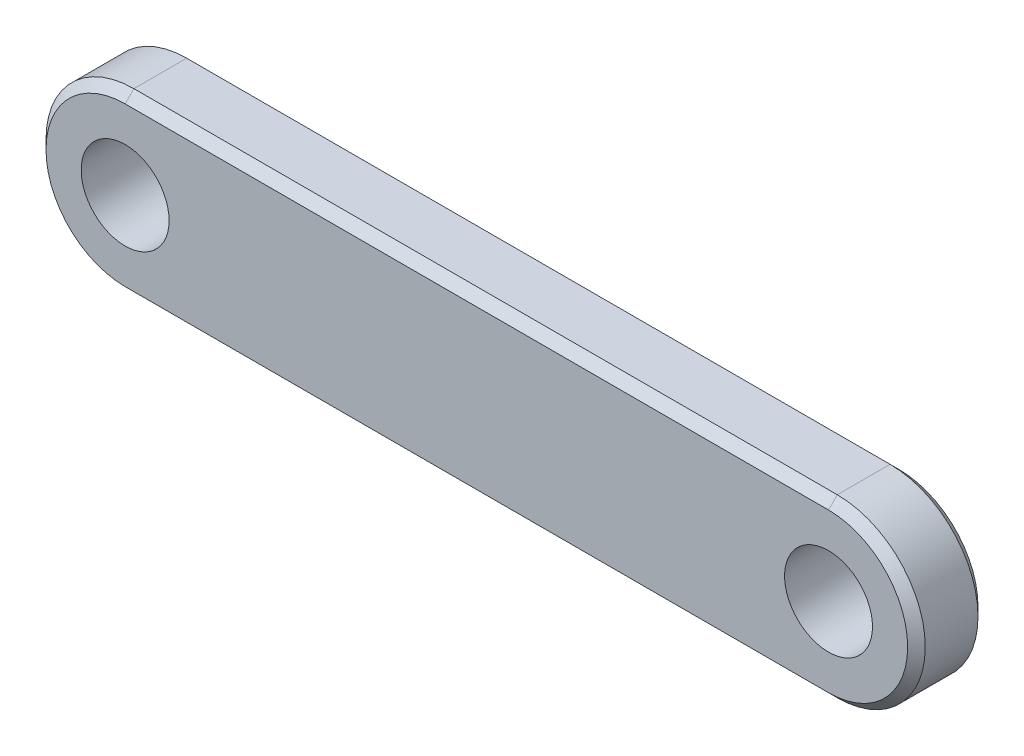
ISO-10303-21;
HEADER;
FILE_DESCRIPTION(('STEP AP214'),'2;1');
FILE_NAME('part.step','',(''),(''),'','','');
FILE_SCHEMA(('AUTOMOTIVE_DESIGN { 1 0 10303 214 1 1 1 1 }'));
ENDSEC;
DATA;
#1=APPLICATION_CONTEXT('core data for automotive mechanical design processes');
#2=APPLICATION_PROTOCOL_DEFINITION('international standard','automotive_design',2000,#1);
#3=PRODUCT_CONTEXT('',#1,'mechanical');
#4=PRODUCT('Part','Part','',(#3));
#5=PRODUCT_RELATED_PRODUCT_CATEGORY('part','',(#4));
#6=PRODUCT_DEFINITION_FORMATION('','',#4);
#7=PRODUCT_DEFINITION_CONTEXT('part definition',#1,'design');
#8=PRODUCT_DEFINITION('design','',#6,#7);
#9=PRODUCT_DEFINITION_SHAPE('','',#8);
#10=(LENGTH_UNIT() NAMED_UNIT(*) SI_UNIT(.MILLI.,.METRE.));
#11=(NAMED_UNIT(*) PLANE_ANGLE_UNIT() SI_UNIT($,.RADIAN.));
#12=(NAMED_UNIT(*) SI_UNIT($,.STERADIAN.) SOLID_ANGLE_UNIT());
#13=UNCERTAINTY_MEASURE_WITH_UNIT(LENGTH_MEASURE(1.E-05),#10,'distance_accuracy_value','');
#14=(GEOMETRIC_REPRESENTATION_CONTEXT(3) GLOBAL_UNCERTAINTY_ASSIGNED_CONTEXT((#13)) GLOBAL_UNIT_ASSIGNED_CONTEXT((#10,
#11,#12)) REPRESENTATION_CONTEXT('',''));
#15=CARTESIAN_POINT('',(0.,0.,0.));
#16=DIRECTION('',(0.,0.,1.));
#17=DIRECTION('',(1.,0.,0.));
#18=AXIS2_PLACEMENT_3D('',#15,#16,#17);
#19=CARTESIAN_POINT('',(-20.,0.,-4.));
#20=DIRECTION('',(0.,0.,1.));
#21=DIRECTION('',(1.,0.,0.));
#22=AXIS2_PLACEMENT_3D('',#19,#20,#21);
#23=CYLINDRICAL_SURFACE('',#22,5.);
#24=DIRECTION('',(0.,0.,1.));
#25=VECTOR('',#24,1.);
#26=CARTESIAN_POINT('',(-20.,5.,-4.));
#27=LINE('',#26,#25);
#28=CARTESIAN_POINT('',(-20.,5.,-3.49999999999999));
#29=VERTEX_POINT('',#28);
#30=CARTESIAN_POINT('',(-20.,5.,-0.5));
#31=VERTEX_POINT('',#30);
#32=EDGE_CURVE('E115',#29,#31,#27,.T.);
#33=ORIENTED_EDGE('',*,*,#32,.F.);
#34=CARTESIAN_POINT('',(-20.,0.,-3.49999999999999));
#35=DIRECTION('',(0.,0.,1.));
#36=DIRECTION('',(1.,0.,0.));
#37=AXIS2_PLACEMENT_3D('',#34,#35,#36);
#38=CIRCLE('',#37,5.);
#39=CARTESIAN_POINT('',(-20.,-5.,-3.49999999999999));
#40=VERTEX_POINT('',#39);
#41=EDGE_CURVE('E111',#29,#40,#38,.T.);
#42=ORIENTED_EDGE('',*,*,#41,.T.);
#43=DIRECTION('',(0.,0.,1.));
#44=VECTOR('',#43,1.);
#45=CARTESIAN_POINT('',(-20.,-5.,-4.));
#46=LINE('',#45,#44);
#47=CARTESIAN_POINT('',(-20.,-5.,-0.5));
#48=VERTEX_POINT('',#47);
#49=EDGE_CURVE('E113',#40,#48,#46,.T.);
#50=ORIENTED_EDGE('',*,*,#49,.T.);
#51=CARTESIAN_POINT('',(-20.,0.,-0.5));
#52=DIRECTION('',(0.,0.,1.));
#53=DIRECTION('',(1.,0.,0.));
#54=AXIS2_PLACEMENT_3D('',#51,#52,#53);
#55=CIRCLE('',#54,5.);
#56=EDGE_CURVE('E121',#48,#31,#55,.F.);
#57=ORIENTED_EDGE('',*,*,#56,.T.);
#58=EDGE_LOOP('',(#33,#42,#50,#57));
#59=FACE_BOUND('',#58,.T.);
#60=ADVANCED_FACE('F41',(#59),#23,.T.);
#61=CARTESIAN_POINT('',(-20.,5.,-4.));
#62=DIRECTION('',(0.,1.,0.));
#63=DIRECTION('',(0.,0.,1.));
#64=AXIS2_PLACEMENT_3D('',#61,#62,#63);
#65=PLANE('',#64);
#66=DIRECTION('',(0.,0.,1.));
#67=VECTOR('',#66,1.);
#68=CARTESIAN_POINT('',(20.,5.,-4.));
#69=LINE('',#68,#67);
#70=CARTESIAN_POINT('',(20.,5.,-3.49999999999999));
#71=VERTEX_POINT('',#70);
#72=CARTESIAN_POINT('',(20.,5.,-0.5));
#73=VERTEX_POINT('',#72);
#74=EDGE_CURVE('E195',#71,#73,#69,.T.);
#75=ORIENTED_EDGE('',*,*,#74,.F.);
#76=DIRECTION('',(-1.,0.,0.));
#77=VECTOR('',#76,1.);
#78=CARTESIAN_POINT('',(-20.,5.,-3.49999999999999));
#79=LINE('',#78,#77);
#80=EDGE_CURVE('E164',#71,#29,#79,.T.);
#81=ORIENTED_EDGE('',*,*,#80,.T.);
#82=ORIENTED_EDGE('',*,*,#32,.T.);
#83=DIRECTION('',(1.,0.,0.));
#84=VECTOR('',#83,1.);
#85=CARTESIAN_POINT('',(-20.,5.,-0.5));
#86=LINE('',#85,#84);
#87=EDGE_CURVE('E120',#31,#73,#86,.T.);
#88=ORIENTED_EDGE('',*,*,#87,.T.);
#89=EDGE_LOOP('',(#75,#81,#82,#88));
#90=FACE_BOUND('',#89,.T.);
#91=ADVANCED_FACE('F194',(#90),#65,.T.);
#92=CARTESIAN_POINT('',(20.,0.,-4.));
#93=DIRECTION('',(0.,0.,1.));
#94=DIRECTION('',(1.,0.,0.));
#95=AXIS2_PLACEMENT_3D('',#92,#93,#94);
#96=CYLINDRICAL_SURFACE('',#95,5.);
#97=DIRECTION('',(0.,0.,1.));
#98=VECTOR('',#97,1.);
#99=CARTESIAN_POINT('',(20.,-5.,-4.));
#100=LINE('',#99,#98);
#101=CARTESIAN_POINT('',(20.,-5.,-3.49999999999999));
#102=VERTEX_POINT('',#101);
#103=CARTESIAN_POINT('',(20.,-5.,-0.5));
#104=VERTEX_POINT('',#103);
#105=EDGE_CURVE('E132',#102,#104,#100,.T.);
#106=ORIENTED_EDGE('',*,*,#105,.F.);
#107=CARTESIAN_POINT('',(20.,0.,-3.49999999999999));
#108=DIRECTION('',(0.,0.,1.));
#109=DIRECTION('',(1.,0.,0.));
#110=AXIS2_PLACEMENT_3D('',#107,#108,#109);
#111=CIRCLE('',#110,5.);
#112=EDGE_CURVE('E160',#102,#71,#111,.T.);
#113=ORIENTED_EDGE('',*,*,#112,.T.);
#114=ORIENTED_EDGE('',*,*,#74,.T.);
#115=CARTESIAN_POINT('',(20.,0.,-0.5));
#116=DIRECTION('',(0.,0.,1.));
#117=DIRECTION('',(1.,0.,0.));
#118=AXIS2_PLACEMENT_3D('',#115,#116,#117);
#119=CIRCLE('',#118,5.);
#120=EDGE_CURVE('E158',#73,#104,#119,.F.);
#121=ORIENTED_EDGE('',*,*,#120,.T.);
#122=EDGE_LOOP('',(#106,#113,#114,#121));
#123=FACE_BOUND('',#122,.T.);
#124=ADVANCED_FACE('F198',(#123),#96,.T.);
#125=CARTESIAN_POINT('',(-20.,-5.,-4.));
#126=DIRECTION('',(0.,-1.,0.));
#127=DIRECTION('',(0.,0.,-1.));
#128=AXIS2_PLACEMENT_3D('',#125,#126,#127);
#129=PLANE('',#128);
#130=ORIENTED_EDGE('',*,*,#49,.F.);
#131=DIRECTION('',(1.,0.,0.));
#132=VECTOR('',#131,1.);
#133=CARTESIAN_POINT('',(20.,-5.,-3.49999999999999));
#134=LINE('',#133,#132);
#135=EDGE_CURVE('E129',#40,#102,#134,.T.);
#136=ORIENTED_EDGE('',*,*,#135,.T.);
#137=ORIENTED_EDGE('',*,*,#105,.T.);
#138=DIRECTION('',(-1.,0.,0.));
#139=VECTOR('',#138,1.);
#140=CARTESIAN_POINT('',(-20.,-5.,-0.5));
#141=LINE('',#140,#139);
#142=EDGE_CURVE('E131',#104,#48,#141,.T.);
#143=ORIENTED_EDGE('',*,*,#142,.T.);
#144=EDGE_LOOP('',(#130,#136,#137,#143));
#145=FACE_BOUND('',#144,.T.);
#146=ADVANCED_FACE('F126',(#145),#129,.T.);
#147=CARTESIAN_POINT('',(-20.,0.,-4.));
#148=DIRECTION('',(0.,0.,1.));
#149=DIRECTION('',(1.,0.,0.));
#150=AXIS2_PLACEMENT_3D('',#147,#148,#149);
#151=PLANE('',#150);
#152=CARTESIAN_POINT('',(20.,0.,-4.));
#153=DIRECTION('',(0.,0.,1.));
#154=DIRECTION('',(1.,0.,0.));
#155=AXIS2_PLACEMENT_3D('',#152,#153,#154);
#156=CIRCLE('',#155,4.49999999999999);
#157=CARTESIAN_POINT('',(20.,4.49999999999999,-4.));
#158=VERTEX_POINT('',#157);
#159=CARTESIAN_POINT('',(20.,-4.49999999999999,-4.));
#160=VERTEX_POINT('',#159);
#161=EDGE_CURVE('E154',#158,#160,#156,.F.);
#162=ORIENTED_EDGE('',*,*,#161,.T.);
#163=DIRECTION('',(-1.,0.,0.));
#164=VECTOR('',#163,1.);
#165=CARTESIAN_POINT('',(-20.,-4.5,-4.));
#166=LINE('',#165,#164);
#167=CARTESIAN_POINT('',(-20.,-4.49999999999999,-4.));
#168=VERTEX_POINT('',#167);
#169=EDGE_CURVE('E156',#160,#168,#166,.T.);
#170=ORIENTED_EDGE('',*,*,#169,.T.);
#171=CARTESIAN_POINT('',(-20.,0.,-4.));
#172=DIRECTION('',(0.,0.,1.));
#173=DIRECTION('',(1.,0.,0.));
#174=AXIS2_PLACEMENT_3D('',#171,#172,#173);
#175=CIRCLE('',#174,4.49999999999999);
#176=CARTESIAN_POINT('',(-20.,4.49999999999999,-4.));
#177=VERTEX_POINT('',#176);
#178=EDGE_CURVE('E138',#168,#177,#175,.F.);
#179=ORIENTED_EDGE('',*,*,#178,.T.);
#180=DIRECTION('',(1.,0.,0.));
#181=VECTOR('',#180,1.);
#182=CARTESIAN_POINT('',(20.,4.49999999999999,-4.));
#183=LINE('',#182,#181);
#184=EDGE_CURVE('E148',#177,#158,#183,.T.);
#185=ORIENTED_EDGE('',*,*,#184,.T.);
#186=EDGE_LOOP('',(#162,#170,#179,#185));
#187=FACE_BOUND('',#186,.T.);
#188=CARTESIAN_POINT('',(20.,0.,-4.));
#189=DIRECTION('',(0.,0.,1.));
#190=DIRECTION('',(1.,0.,0.));
#191=AXIS2_PLACEMENT_3D('',#188,#189,#190);
#192=CIRCLE('',#191,2.5);
#193=CARTESIAN_POINT('',(22.5,0.,-4.));
#194=VERTEX_POINT('',#193);
#195=EDGE_CURVE('E206',#194,#194,#192,.T.);
#196=ORIENTED_EDGE('',*,*,#195,.T.);
#197=EDGE_LOOP('',(#196));
#198=FACE_BOUND('',#197,.T.);
#199=CARTESIAN_POINT('',(-20.,0.,-4.));
#200=DIRECTION('',(0.,0.,1.));
#201=DIRECTION('',(1.,0.,0.));
#202=AXIS2_PLACEMENT_3D('',#199,#200,#201);
#203=CIRCLE('',#202,2.5);
#204=CARTESIAN_POINT('',(-17.5,0.,-4.));
#205=VERTEX_POINT('',#204);
#206=EDGE_CURVE('E133',#205,#205,#203,.T.);
#207=ORIENTED_EDGE('',*,*,#206,.T.);
#208=EDGE_LOOP('',(#207));
#209=FACE_BOUND('',#208,.T.);
#210=ADVANCED_FACE('F214',(#187,#198,#209),#151,.F.);
#211=CARTESIAN_POINT('',(-20.,0.,0.));
#212=DIRECTION('',(0.,0.,1.));
#213=DIRECTION('',(1.,0.,0.));
#214=AXIS2_PLACEMENT_3D('',#211,#212,#213);
#215=PLANE('',#214);
#216=CARTESIAN_POINT('',(-20.,0.,0.));
#217=DIRECTION('',(0.,0.,1.));
#218=DIRECTION('',(1.,0.,0.));
#219=AXIS2_PLACEMENT_3D('',#216,#217,#218);
#220=CIRCLE('',#219,4.5);
#221=CARTESIAN_POINT('',(-20.,4.5,0.));
#222=VERTEX_POINT('',#221);
#223=CARTESIAN_POINT('',(-20.,-4.5,0.));
#224=VERTEX_POINT('',#223);
#225=EDGE_CURVE('E65',#222,#224,#220,.T.);
#226=ORIENTED_EDGE('',*,*,#225,.T.);
#227=DIRECTION('',(1.,0.,0.));
#228=VECTOR('',#227,1.);
#229=CARTESIAN_POINT('',(-20.,-4.5,0.));
#230=LINE('',#229,#228);
#231=CARTESIAN_POINT('',(20.,-4.5,0.));
#232=VERTEX_POINT('',#231);
#233=EDGE_CURVE('E11',#224,#232,#230,.T.);
#234=ORIENTED_EDGE('',*,*,#233,.T.);
#235=CARTESIAN_POINT('',(20.,0.,0.));
#236=DIRECTION('',(0.,0.,1.));
#237=DIRECTION('',(1.,0.,0.));
#238=AXIS2_PLACEMENT_3D('',#235,#236,#237);
#239=CIRCLE('',#238,4.5);
#240=CARTESIAN_POINT('',(20.,4.5,0.));
#241=VERTEX_POINT('',#240);
#242=EDGE_CURVE('E50',#232,#241,#239,.T.);
#243=ORIENTED_EDGE('',*,*,#242,.T.);
#244=DIRECTION('',(-1.,0.,0.));
#245=VECTOR('',#244,1.);
#246=CARTESIAN_POINT('',(-20.,4.5,0.));
#247=LINE('',#246,#245);
#248=EDGE_CURVE('E166',#241,#222,#247,.T.);
#249=ORIENTED_EDGE('',*,*,#248,.T.);
#250=EDGE_LOOP('',(#226,#234,#243,#249));
#251=FACE_BOUND('',#250,.T.);
#252=CARTESIAN_POINT('',(20.,0.,0.));
#253=DIRECTION('',(0.,0.,1.));
#254=DIRECTION('',(1.,0.,0.));
#255=AXIS2_PLACEMENT_3D('',#252,#253,#254);
#256=CIRCLE('',#255,2.5);
#257=CARTESIAN_POINT('',(22.5,0.,0.));
#258=VERTEX_POINT('',#257);
#259=EDGE_CURVE('E175',#258,#258,#256,.T.);
#260=ORIENTED_EDGE('',*,*,#259,.F.);
#261=EDGE_LOOP('',(#260));
#262=FACE_BOUND('',#261,.T.);
#263=CARTESIAN_POINT('',(-20.,0.,0.));
#264=DIRECTION('',(0.,0.,1.));
#265=DIRECTION('',(1.,0.,0.));
#266=AXIS2_PLACEMENT_3D('',#263,#264,#265);
#267=CIRCLE('',#266,2.5);
#268=CARTESIAN_POINT('',(-17.5,0.,0.));
#269=VERTEX_POINT('',#268);
#270=EDGE_CURVE('E203',#269,#269,#267,.T.);
#271=ORIENTED_EDGE('',*,*,#270,.F.);
#272=EDGE_LOOP('',(#271));
#273=FACE_BOUND('',#272,.T.);
#274=ADVANCED_FACE('F225',(#251,#262,#273),#215,.T.);
#275=CARTESIAN_POINT('',(-20.,0.,-4.));
#276=DIRECTION('',(0.,0.,1.));
#277=DIRECTION('',(1.,0.,0.));
#278=AXIS2_PLACEMENT_3D('',#275,#276,#277);
#279=CYLINDRICAL_SURFACE('',#278,2.5);
#280=ORIENTED_EDGE('',*,*,#206,.F.);
#281=EDGE_LOOP('',(#280));
#282=FACE_BOUND('',#281,.T.);
#283=ORIENTED_EDGE('',*,*,#270,.T.);
#284=EDGE_LOOP('',(#283));
#285=FACE_BOUND('',#284,.T.);
#286=ADVANCED_FACE('F221',(#282,#285),#279,.F.);
#287=CARTESIAN_POINT('',(20.,0.,-4.));
#288=DIRECTION('',(0.,0.,1.));
#289=DIRECTION('',(1.,0.,0.));
#290=AXIS2_PLACEMENT_3D('',#287,#288,#289);
#291=CYLINDRICAL_SURFACE('',#290,2.5);
#292=ORIENTED_EDGE('',*,*,#195,.F.);
#293=EDGE_LOOP('',(#292));
#294=FACE_BOUND('',#293,.T.);
#295=ORIENTED_EDGE('',*,*,#259,.T.);
#296=EDGE_LOOP('',(#295));
#297=FACE_BOUND('',#296,.T.);
#298=ADVANCED_FACE('F217',(#294,#297),#291,.F.);
#299=CARTESIAN_POINT('',(-20.,5.,-3.49999999999999));
#300=DIRECTION('',(0.,0.707106781186547,-0.707106781186547));
#301=DIRECTION('',(1.,0.,0.));
#302=AXIS2_PLACEMENT_3D('',#299,#300,#301);
#303=PLANE('',#302);
#304=DIRECTION('',(0.,0.707106781186547,0.707106781186547));
#305=VECTOR('',#304,1.);
#306=CARTESIAN_POINT('',(20.,4.49999999999999,-4.));
#307=LINE('',#306,#305);
#308=EDGE_CURVE('E142',#158,#71,#307,.T.);
#309=ORIENTED_EDGE('',*,*,#308,.F.);
#310=ORIENTED_EDGE('',*,*,#184,.F.);
#311=DIRECTION('',(0.,-0.707106781186547,-0.707106781186547));
#312=VECTOR('',#311,1.);
#313=CARTESIAN_POINT('',(-20.,5.,-3.49999999999999));
#314=LINE('',#313,#312);
#315=EDGE_CURVE('E173',#29,#177,#314,.T.);
#316=ORIENTED_EDGE('',*,*,#315,.F.);
#317=ORIENTED_EDGE('',*,*,#80,.F.);
#318=EDGE_LOOP('',(#309,#310,#316,#317));
#319=FACE_BOUND('',#318,.T.);
#320=ADVANCED_FACE('F220',(#319),#303,.T.);
#321=CARTESIAN_POINT('',(-20.,0.,-3.49999999999999));
#322=DIRECTION('',(0.,0.,1.));
#323=DIRECTION('',(1.,0.,0.));
#324=AXIS2_PLACEMENT_3D('',#321,#322,#323);
#325=CONICAL_SURFACE('',#324,5.,0.785398163397448);
#326=ORIENTED_EDGE('',*,*,#315,.T.);
#327=ORIENTED_EDGE('',*,*,#178,.F.);
#328=DIRECTION('',(0.,0.707106781186547,-0.707106781186547));
#329=VECTOR('',#328,1.);
#330=CARTESIAN_POINT('',(-20.,-5.,-3.49999999999999));
#331=LINE('',#330,#329);
#332=EDGE_CURVE('E136',#40,#168,#331,.T.);
#333=ORIENTED_EDGE('',*,*,#332,.F.);
#334=ORIENTED_EDGE('',*,*,#41,.F.);
#335=EDGE_LOOP('',(#326,#327,#333,#334));
#336=FACE_BOUND('',#335,.T.);
#337=ADVANCED_FACE('F137',(#336),#325,.T.);
#338=CARTESIAN_POINT('',(20.,0.,-3.49999999999999));
#339=DIRECTION('',(0.,0.,1.));
#340=DIRECTION('',(1.,0.,0.));
#341=AXIS2_PLACEMENT_3D('',#338,#339,#340);
#342=CONICAL_SURFACE('',#341,5.,0.785398163397448);
#343=ORIENTED_EDGE('',*,*,#308,.T.);
#344=ORIENTED_EDGE('',*,*,#112,.F.);
#345=DIRECTION('',(0.,-0.707106781186547,0.707106781186547));
#346=VECTOR('',#345,1.);
#347=CARTESIAN_POINT('',(20.,-4.49999999999999,-4.));
#348=LINE('',#347,#346);
#349=EDGE_CURVE('E143',#160,#102,#348,.T.);
#350=ORIENTED_EDGE('',*,*,#349,.F.);
#351=ORIENTED_EDGE('',*,*,#161,.F.);
#352=EDGE_LOOP('',(#343,#344,#350,#351));
#353=FACE_BOUND('',#352,.T.);
#354=ADVANCED_FACE('F249',(#353),#342,.T.);
#355=CARTESIAN_POINT('',(-20.,-5.,-3.49999999999999));
#356=DIRECTION('',(0.,-0.707106781186547,-0.707106781186547));
#357=DIRECTION('',(-1.,0.,0.));
#358=AXIS2_PLACEMENT_3D('',#355,#356,#357);
#359=PLANE('',#358);
#360=ORIENTED_EDGE('',*,*,#332,.T.);
#361=ORIENTED_EDGE('',*,*,#169,.F.);
#362=ORIENTED_EDGE('',*,*,#349,.T.);
#363=ORIENTED_EDGE('',*,*,#135,.F.);
#364=EDGE_LOOP('',(#360,#361,#362,#363));
#365=FACE_BOUND('',#364,.T.);
#366=ADVANCED_FACE('F145',(#365),#359,.T.);
#367=CARTESIAN_POINT('',(-20.,4.5,0.));
#368=DIRECTION('',(0.,-0.707106781186547,-0.707106781186547));
#369=DIRECTION('',(-1.,0.,0.));
#370=AXIS2_PLACEMENT_3D('',#367,#368,#369);
#371=PLANE('',#370);
#372=DIRECTION('',(0.,-0.707106781186547,0.707106781186547));
#373=VECTOR('',#372,1.);
#374=CARTESIAN_POINT('',(20.,5.,-0.5));
#375=LINE('',#374,#373);
#376=EDGE_CURVE('E178',#73,#241,#375,.T.);
#377=ORIENTED_EDGE('',*,*,#376,.F.);
#378=ORIENTED_EDGE('',*,*,#87,.F.);
#379=DIRECTION('',(0.,0.707106781186547,-0.707106781186547));
#380=VECTOR('',#379,1.);
#381=CARTESIAN_POINT('',(-20.,4.5,0.));
#382=LINE('',#381,#380);
#383=EDGE_CURVE('E45',#222,#31,#382,.T.);
#384=ORIENTED_EDGE('',*,*,#383,.F.);
#385=ORIENTED_EDGE('',*,*,#248,.F.);
#386=EDGE_LOOP('',(#377,#378,#384,#385));
#387=FACE_BOUND('',#386,.T.);
#388=ADVANCED_FACE('F43',(#387),#371,.F.);
#389=CARTESIAN_POINT('',(-20.,0.,0.));
#390=DIRECTION('',(0.,0.,-1.));
#391=DIRECTION('',(-1.,0.,0.));
#392=AXIS2_PLACEMENT_3D('',#389,#390,#391);
#393=CONICAL_SURFACE('',#392,4.5,0.785398163397448);
#394=ORIENTED_EDGE('',*,*,#383,.T.);
#395=ORIENTED_EDGE('',*,*,#56,.F.);
#396=DIRECTION('',(0.,-0.707106781186547,-0.707106781186547));
#397=VECTOR('',#396,1.);
#398=CARTESIAN_POINT('',(-20.,-4.5,0.));
#399=LINE('',#398,#397);
#400=EDGE_CURVE('E177',#224,#48,#399,.T.);
#401=ORIENTED_EDGE('',*,*,#400,.F.);
#402=ORIENTED_EDGE('',*,*,#225,.F.);
#403=EDGE_LOOP('',(#394,#395,#401,#402));
#404=FACE_BOUND('',#403,.T.);
#405=ADVANCED_FACE('F187',(#404),#393,.T.);
#406=CARTESIAN_POINT('',(20.,0.,0.));
#407=DIRECTION('',(0.,0.,-1.));
#408=DIRECTION('',(-1.,0.,0.));
#409=AXIS2_PLACEMENT_3D('',#406,#407,#408);
#410=CONICAL_SURFACE('',#409,4.5,0.785398163397448);
#411=ORIENTED_EDGE('',*,*,#376,.T.);
#412=ORIENTED_EDGE('',*,*,#242,.F.);
#413=DIRECTION('',(0.,0.707106781186547,0.707106781186547));
#414=VECTOR('',#413,1.);
#415=CARTESIAN_POINT('',(20.,-5.,-0.5));
#416=LINE('',#415,#414);
#417=EDGE_CURVE('E58',#104,#232,#416,.T.);
#418=ORIENTED_EDGE('',*,*,#417,.F.);
#419=ORIENTED_EDGE('',*,*,#120,.F.);
#420=EDGE_LOOP('',(#411,#412,#418,#419));
#421=FACE_BOUND('',#420,.T.);
#422=ADVANCED_FACE('F261',(#421),#410,.T.);
#423=CARTESIAN_POINT('',(-20.,-4.5,0.));
#424=DIRECTION('',(0.,0.707106781186547,-0.707106781186547));
#425=DIRECTION('',(1.,0.,0.));
#426=AXIS2_PLACEMENT_3D('',#423,#424,#425);
#427=PLANE('',#426);
#428=ORIENTED_EDGE('',*,*,#400,.T.);
#429=ORIENTED_EDGE('',*,*,#142,.F.);
#430=ORIENTED_EDGE('',*,*,#417,.T.);
#431=ORIENTED_EDGE('',*,*,#233,.F.);
#432=EDGE_LOOP('',(#428,#429,#430,#431));
#433=FACE_BOUND('',#432,.T.);
#434=ADVANCED_FACE('F258',(#433),#427,.F.);
#435=CLOSED_SHELL('',(#60,#91,#124,#146,#210,#274,#286,#298,#320,#337,#354,#366,#388,#405,#422,#434));
#436=MANIFOLD_SOLID_BREP('B2',#435);
#437=ADVANCED_BREP_SHAPE_REPRESENTATION('',(#18,#436),#14);
#438=SHAPE_DEFINITION_REPRESENTATION(#9,#437);
ENDSEC;
END-ISO-10303-21;
